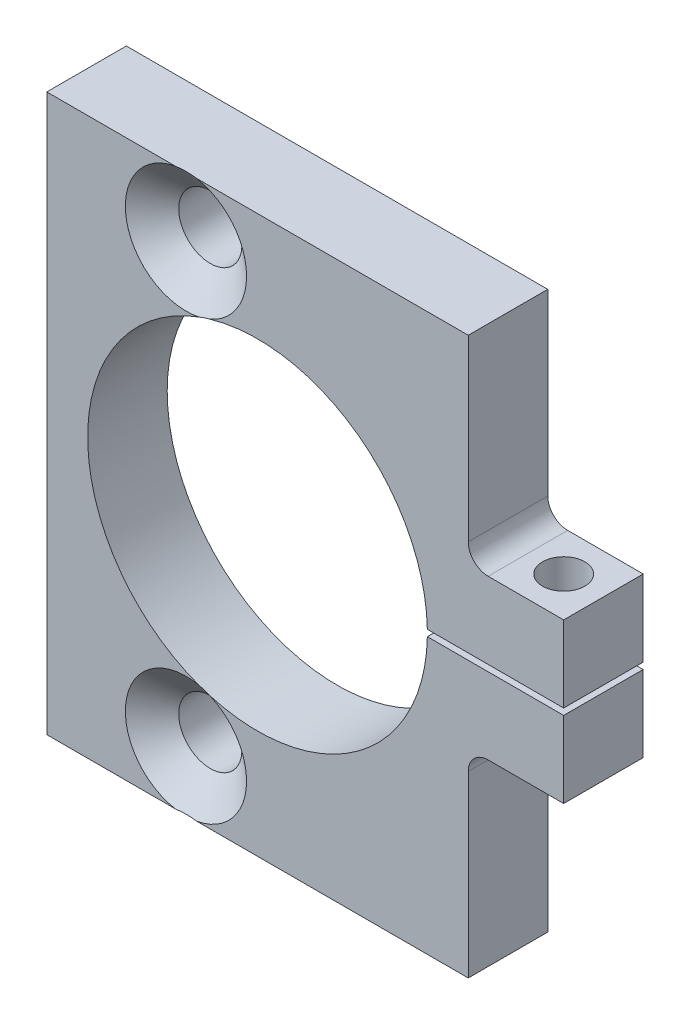
ISO-10303-21;
HEADER;
FILE_DESCRIPTION(('STEP AP214'),'2;1');
FILE_NAME('part.step','',(''),(''),'','','');
FILE_SCHEMA(('AUTOMOTIVE_DESIGN { 1 0 10303 214 1 1 1 1 }'));
ENDSEC;
DATA;
#1=APPLICATION_CONTEXT('core data for automotive mechanical design processes');
#2=APPLICATION_PROTOCOL_DEFINITION('international standard','automotive_design',2000,#1);
#3=PRODUCT_CONTEXT('',#1,'mechanical');
#4=PRODUCT('Part','Part','',(#3));
#5=PRODUCT_RELATED_PRODUCT_CATEGORY('part','',(#4));
#6=PRODUCT_DEFINITION_FORMATION('','',#4);
#7=PRODUCT_DEFINITION_CONTEXT('part definition',#1,'design');
#8=PRODUCT_DEFINITION('design','',#6,#7);
#9=PRODUCT_DEFINITION_SHAPE('','',#8);
#10=(LENGTH_UNIT() NAMED_UNIT(*) SI_UNIT(.MILLI.,.METRE.));
#11=(NAMED_UNIT(*) PLANE_ANGLE_UNIT() SI_UNIT($,.RADIAN.));
#12=(NAMED_UNIT(*) SI_UNIT($,.STERADIAN.) SOLID_ANGLE_UNIT());
#13=UNCERTAINTY_MEASURE_WITH_UNIT(LENGTH_MEASURE(1.E-05),#10,'distance_accuracy_value','');
#14=(GEOMETRIC_REPRESENTATION_CONTEXT(3) GLOBAL_UNCERTAINTY_ASSIGNED_CONTEXT((#13)) GLOBAL_UNIT_ASSIGNED_CONTEXT((#10,
#11,#12)) REPRESENTATION_CONTEXT('',''));
#15=CARTESIAN_POINT('',(0.,0.,0.));
#16=DIRECTION('',(0.,0.,1.));
#17=DIRECTION('',(1.,0.,0.));
#18=AXIS2_PLACEMENT_3D('',#15,#16,#17);
#19=CARTESIAN_POINT('',(41.275,44.45,12.7));
#20=DIRECTION('',(0.,0.,-1.));
#21=DIRECTION('',(-1.,0.,0.));
#22=AXIS2_PLACEMENT_3D('',#19,#20,#21);
#23=PLANE('',#22);
#24=DIRECTION('',(0.,1.,0.));
#25=VECTOR('',#24,1.);
#26=CARTESIAN_POINT('',(26.035,-44.45,12.7));
#27=LINE('',#26,#25);
#28=CARTESIAN_POINT('',(26.035,-44.45,12.7));
#29=VERTEX_POINT('',#28);
#30=CARTESIAN_POINT('',(26.035,-15.875,12.7));
#31=VERTEX_POINT('',#30);
#32=EDGE_CURVE('E174',#29,#31,#27,.T.);
#33=ORIENTED_EDGE('',*,*,#32,.T.);
#34=CARTESIAN_POINT('',(29.21,-15.875,12.7));
#35=DIRECTION('',(0.,0.,-1.));
#36=DIRECTION('',(-1.,0.,0.));
#37=AXIS2_PLACEMENT_3D('',#34,#35,#36);
#38=CIRCLE('',#37,3.175);
#39=CARTESIAN_POINT('',(29.21,-12.7,12.7));
#40=VERTEX_POINT('',#39);
#41=EDGE_CURVE('E402',#31,#40,#38,.T.);
#42=ORIENTED_EDGE('',*,*,#41,.T.);
#43=DIRECTION('',(1.,0.,0.));
#44=VECTOR('',#43,1.);
#45=CARTESIAN_POINT('',(41.275,-12.7,12.7));
#46=LINE('',#45,#44);
#47=CARTESIAN_POINT('',(41.275,-12.7,12.7));
#48=VERTEX_POINT('',#47);
#49=EDGE_CURVE('E406',#40,#48,#46,.T.);
#50=ORIENTED_EDGE('',*,*,#49,.T.);
#51=DIRECTION('',(0.,1.,0.));
#52=VECTOR('',#51,1.);
#53=CARTESIAN_POINT('',(41.275,-44.45,12.7));
#54=LINE('',#53,#52);
#55=CARTESIAN_POINT('',(41.275,-0.508000000000002,12.7));
#56=VERTEX_POINT('',#55);
#57=EDGE_CURVE('E181',#48,#56,#54,.T.);
#58=ORIENTED_EDGE('',*,*,#57,.T.);
#59=DIRECTION('',(1.,0.,0.));
#60=VECTOR('',#59,1.);
#61=CARTESIAN_POINT('',(16.1567832729253,-0.508000000000002,12.7));
#62=LINE('',#61,#60);
#63=CARTESIAN_POINT('',(19.5024430286064,-0.508000000000002,12.7));
#64=VERTEX_POINT('',#63);
#65=EDGE_CURVE('E409',#64,#56,#62,.T.);
#66=ORIENTED_EDGE('',*,*,#65,.F.);
#67=CARTESIAN_POINT('',(-7.62000000000001,0.,12.7));
#68=DIRECTION('',(0.,0.,1.));
#69=DIRECTION('',(1.,0.,0.));
#70=AXIS2_PLACEMENT_3D('',#67,#68,#69);
#71=CIRCLE('',#70,27.1272);
#72=CARTESIAN_POINT('',(-15.198154866507,-26.0471984800522,12.7));
#73=VERTEX_POINT('',#72);
#74=EDGE_CURVE('E319',#73,#64,#71,.T.);
#75=ORIENTED_EDGE('',*,*,#74,.F.);
#76=CARTESIAN_POINT('',(-19.05,-34.925,12.7));
#77=DIRECTION('',(0.,0.,1.));
#78=DIRECTION('',(1.,0.,0.));
#79=AXIS2_PLACEMENT_3D('',#76,#77,#78);
#80=CIRCLE('',#79,9.6774);
#81=CARTESIAN_POINT('',(-17.339314242767,-44.45,12.7));
#82=VERTEX_POINT('',#81);
#83=EDGE_CURVE('E312',#82,#73,#80,.T.);
#84=ORIENTED_EDGE('',*,*,#83,.F.);
#85=DIRECTION('',(1.,0.,0.));
#86=VECTOR('',#85,1.);
#87=CARTESIAN_POINT('',(-41.275,-44.45,12.7));
#88=LINE('',#87,#86);
#89=EDGE_CURVE('E329',#82,#29,#88,.T.);
#90=ORIENTED_EDGE('',*,*,#89,.T.);
#91=EDGE_LOOP('',(#33,#42,#50,#58,#66,#75,#84,#90));
#92=FACE_BOUND('',#91,.T.);
#93=ADVANCED_FACE('F37',(#92),#23,.F.);
#94=CARTESIAN_POINT('',(41.275,-44.45,12.7));
#95=DIRECTION('',(-1.,0.,0.));
#96=DIRECTION('',(0.,0.,1.));
#97=AXIS2_PLACEMENT_3D('',#94,#95,#96);
#98=PLANE('',#97);
#99=DIRECTION('',(0.,0.,1.));
#100=VECTOR('',#99,1.);
#101=CARTESIAN_POINT('',(41.275,-12.7,0.));
#102=LINE('',#101,#100);
#103=CARTESIAN_POINT('',(41.275,-12.7,0.));
#104=VERTEX_POINT('',#103);
#105=EDGE_CURVE('E166',#104,#48,#102,.T.);
#106=ORIENTED_EDGE('',*,*,#105,.F.);
#107=DIRECTION('',(0.,1.,0.));
#108=VECTOR('',#107,1.);
#109=CARTESIAN_POINT('',(41.275,-44.45,0.));
#110=LINE('',#109,#108);
#111=CARTESIAN_POINT('',(41.275,-0.508000000000002,0.));
#112=VERTEX_POINT('',#111);
#113=EDGE_CURVE('E179',#104,#112,#110,.T.);
#114=ORIENTED_EDGE('',*,*,#113,.T.);
#115=DIRECTION('',(0.,0.,1.));
#116=VECTOR('',#115,1.);
#117=CARTESIAN_POINT('',(41.275,-0.508000000000002,12.7));
#118=LINE('',#117,#116);
#119=EDGE_CURVE('E321',#112,#56,#118,.T.);
#120=ORIENTED_EDGE('',*,*,#119,.T.);
#121=ORIENTED_EDGE('',*,*,#57,.F.);
#122=EDGE_LOOP('',(#106,#114,#120,#121));
#123=FACE_BOUND('',#122,.T.);
#124=ADVANCED_FACE('F177',(#123),#98,.F.);
#125=CARTESIAN_POINT('',(-41.275,-44.45,12.7));
#126=DIRECTION('',(0.,1.,0.));
#127=DIRECTION('',(0.,0.,1.));
#128=AXIS2_PLACEMENT_3D('',#125,#126,#127);
#129=PLANE('',#128);
#130=DIRECTION('',(0.,0.,1.));
#131=VECTOR('',#130,1.);
#132=CARTESIAN_POINT('',(26.035,-44.45,0.));
#133=LINE('',#132,#131);
#134=CARTESIAN_POINT('',(26.035,-44.45,0.));
#135=VERTEX_POINT('',#134);
#136=EDGE_CURVE('E182',#135,#29,#133,.T.);
#137=ORIENTED_EDGE('',*,*,#136,.T.);
#138=ORIENTED_EDGE('',*,*,#89,.F.);
#139=CARTESIAN_POINT('',(-37.3789065683908,-44.45,21.9122225883036));
#140=CARTESIAN_POINT('',(-36.9777970751316,-44.45,21.613608142832));
#141=CARTESIAN_POINT('',(-36.5757182030523,-44.45,21.3162851750371));
#142=CARTESIAN_POINT('',(-35.7691723423192,-44.45,20.7248429279077));
#143=CARTESIAN_POINT('',(-35.3647052008841,-44.45,20.4307238570317));
#144=CARTESIAN_POINT('',(-34.552036967872,-44.45,19.8456662634173));
#145=CARTESIAN_POINT('',(-34.1438293601787,-44.45,19.5547367772536));
#146=CARTESIAN_POINT('',(-33.3240650152779,-44.45,18.9776482350215));
#147=CARTESIAN_POINT('',(-32.9125083558428,-44.45,18.6914890686434));
#148=CARTESIAN_POINT('',(-32.0657165219331,-44.45,18.11163921912));
#149=CARTESIAN_POINT('',(-31.6302844161899,-44.45,17.8182354451884));
#150=CARTESIAN_POINT('',(-30.7539279555369,-44.45,17.2396598245329));
#151=CARTESIAN_POINT('',(-30.31300327215,-44.45,16.9544884735553));
#152=CARTESIAN_POINT('',(-29.4248169839805,-44.45,16.3951131409073));
#153=CARTESIAN_POINT('',(-28.9775618312723,-44.45,16.1208989481245));
#154=CARTESIAN_POINT('',(-28.0747127136942,-44.45,15.586575121114));
#155=CARTESIAN_POINT('',(-27.6191199953543,-44.45,15.3264634011319));
#156=CARTESIAN_POINT('',(-26.9291347800008,-44.45,14.9511892102019));
#157=CARTESIAN_POINT('',(-26.6986310187849,-44.45,14.8288704811586));
#158=CARTESIAN_POINT('',(-26.2347870604906,-44.45,14.589746444186));
#159=CARTESIAN_POINT('',(-26.0014470191728,-44.45,14.4729408351964));
#160=CARTESIAN_POINT('',(-25.5315073168602,-44.45,14.2456979568016));
#161=CARTESIAN_POINT('',(-25.2949058203959,-44.45,14.1352644712514));
#162=CARTESIAN_POINT('',(-24.8183123695346,-44.45,13.9219486389381));
#163=CARTESIAN_POINT('',(-24.5783204574972,-44.45,13.8190661979319));
#164=CARTESIAN_POINT('',(-24.0974833822219,-44.45,13.6232698676627));
#165=CARTESIAN_POINT('',(-23.8566793421862,-44.45,13.5302554587116));
#166=CARTESIAN_POINT('',(-23.3713836697105,-44.45,13.354292684437));
#167=CARTESIAN_POINT('',(-23.1268918238386,-44.45,13.2713449042525));
#168=CARTESIAN_POINT('',(-22.6345450881543,-44.45,13.1172010893614));
#169=CARTESIAN_POINT('',(-22.3866948153663,-44.45,13.0459904039961));
#170=CARTESIAN_POINT('',(-21.8875875928328,-44.45,12.9168694133885));
#171=CARTESIAN_POINT('',(-21.6363315119804,-44.45,12.8589557809905));
#172=CARTESIAN_POINT('',(-21.165465772855,-44.45,12.7649389939614));
#173=CARTESIAN_POINT('',(-20.9462371463384,-44.45,12.7269346624769));
#174=CARTESIAN_POINT('',(-20.5058095935447,-44.45,12.6628834692872));
#175=CARTESIAN_POINT('',(-20.2846088856311,-44.45,12.6368488438681));
#176=CARTESIAN_POINT('',(-19.738850807055,-44.45,12.5884447246165));
#177=CARTESIAN_POINT('',(-19.4136183919624,-44.45,12.5732874636562));
#178=CARTESIAN_POINT('',(-18.7629724827444,-44.45,12.5710841611875));
#179=CARTESIAN_POINT('',(-18.4375589645166,-44.45,12.5840475836853));
#180=CARTESIAN_POINT('',(-17.7885183469015,-44.45,12.6373464678676));
#181=CARTESIAN_POINT('',(-17.4648946403033,-44.45,12.6777227701142));
#182=CARTESIAN_POINT('',(-16.8218568338894,-44.45,12.7836168356787));
#183=CARTESIAN_POINT('',(-16.5024430838655,-44.45,12.8491366746411));
#184=CARTESIAN_POINT('',(-15.6680633923492,-44.45,13.0507554836747));
#185=CARTESIAN_POINT('',(-15.1575164848273,-44.45,13.205265002259));
#186=CARTESIAN_POINT('',(-14.4036837478423,-44.45,13.4702594151555));
#187=CARTESIAN_POINT('',(-14.1542641883008,-44.45,13.5641928093957));
#188=CARTESIAN_POINT('',(-13.6592099819137,-44.45,13.7615655251344));
#189=CARTESIAN_POINT('',(-13.4135750086328,-44.45,13.8650040213603));
#190=CARTESIAN_POINT('',(-12.9228940548355,-44.45,14.0812887570081));
#191=CARTESIAN_POINT('',(-12.677892588514,-44.45,14.1942351735886));
#192=CARTESIAN_POINT('',(-12.1912632266391,-44.45,14.4271656175662));
#193=CARTESIAN_POINT('',(-11.9496353765326,-44.45,14.547149739657));
#194=CARTESIAN_POINT('',(-11.4695626594991,-44.45,14.793043474119));
#195=CARTESIAN_POINT('',(-11.2311163945184,-44.45,14.9189503659205));
#196=CARTESIAN_POINT('',(-10.7570045780567,-44.45,15.1758562240116));
#197=CARTESIAN_POINT('',(-10.5213388984705,-44.45,15.30685495451));
#198=CARTESIAN_POINT('',(-9.99314671211864,-44.45,15.6069300567459));
#199=CARTESIAN_POINT('',(-9.70132799793763,-44.45,15.777250968638));
#200=CARTESIAN_POINT('',(-9.1210741274887,-44.45,16.1235745750786));
#201=CARTESIAN_POINT('',(-8.83263913188914,-44.45,16.2995775379497));
#202=CARTESIAN_POINT('',(-8.25866696031577,-44.45,16.6563587652642));
#203=CARTESIAN_POINT('',(-7.97313034527321,-44.45,16.8371379305564));
#204=CARTESIAN_POINT('',(-7.40462675685225,-44.45,17.2026971333723));
#205=CARTESIAN_POINT('',(-7.1216598371577,-44.45,17.3874772542088));
#206=CARTESIAN_POINT('',(-6.27568135724284,-44.45,17.947162812062));
#207=CARTESIAN_POINT('',(-5.71602532175119,-44.45,18.3271415066067));
#208=CARTESIAN_POINT('',(-4.60364642423928,-44.45,19.0969492871714));
#209=CARTESIAN_POINT('',(-4.05092290644837,-44.45,19.4867774308207));
#210=CARTESIAN_POINT('',(-2.94911636600263,-44.45,20.2751460685569));
#211=CARTESIAN_POINT('',(-2.40005015089908,-44.45,20.6737100112717));
#212=CARTESIAN_POINT('',(-1.30617402706681,-44.45,21.4766481601603));
#213=CARTESIAN_POINT('',(-0.761364206019799,-44.45,21.8810224855435));
#214=CARTESIAN_POINT('',(0.32459011064002,-44.45,22.6941530540228));
#215=CARTESIAN_POINT('',(0.865736140748523,-44.45,23.1029072502087));
#216=CARTESIAN_POINT('',(1.94524232055057,-44.45,23.9240658806977));
#217=CARTESIAN_POINT('',(2.48360249017919,-44.45,24.3364702888231));
#218=CARTESIAN_POINT('',(3.97057820624368,-44.45,25.4820442771918));
#219=CARTESIAN_POINT('',(4.91677740578391,-44.45,26.2183494667041));
#220=CARTESIAN_POINT('',(6.80415094930306,-44.45,27.6976109581132));
#221=CARTESIAN_POINT('',(7.74532461824585,-44.45,28.4405681193342));
#222=CARTESIAN_POINT('',(9.61826568990613,-44.45,29.9269393962963));
#223=CARTESIAN_POINT('',(10.5500558166197,-44.45,30.6703248956648));
#224=CARTESIAN_POINT('',(11.9454719689628,-44.45,31.7880879066351));
#225=CARTESIAN_POINT('',(12.4101973791179,-44.45,32.1610946663902));
#226=CARTESIAN_POINT('',(13.3389959089699,-44.45,32.9079180281409));
#227=CARTESIAN_POINT('',(13.8030690296602,-44.45,33.281734628901));
#228=CARTESIAN_POINT('',(14.2668568821521,-44.45,33.6559049075208));
#229=B_SPLINE_CURVE_WITH_KNOTS('',3,(#139,#140,#141,#142,#143,#144,#145,#146,#147,#148,#149,
#150,#151,#152,#153,#154,#155,#156,#157,#158,#159,#160,#161,#162,#163,#164,#165,#166,#167,#168,
#169,#170,#171,#172,#173,#174,#175,#176,#177,#178,#179,#180,#181,#182,#183,#184,#185,#186,#187,
#188,#189,#190,#191,#192,#193,#194,#195,#196,#197,#198,#199,#200,#201,#202,#203,#204,#205,#206,
#207,#208,#209,#210,#211,#212,#213,#214,#215,#216,#217,#218,#219,#220,#221,#222,#223,#224,#225,
#226,#227,#228),.UNSPECIFIED.,.F.,.F.,(4,2,2,2,2,2,2,2,2,2,2,2,2,2,2,2,2,2,2,2,2,2,2,2,2,2,2,2,
2,2,2,2,2,2,2,2,2,2,2,2,2,2,2,2,4),(0.,1.50018508266125,3.0004671972828,4.50425457600884,
6.00800713250038,7.58311210459571,9.15831173056199,10.7320074401641,12.305469761833,
13.0882550462338,13.870997534725,14.6542001418307,15.437392972273,16.2116318306802,
16.9859156714355,17.7592255816378,18.5323417847619,19.1995251441862,19.8673890377,
20.8428895443382,21.8187184062641,22.7960042879146,23.7733708636462,25.370429140329,
26.1698778860053,26.9692572856691,27.7784819985516,28.5877176022014,29.3965850529846,
30.2054150915161,31.2189939035156,32.2326206498303,33.2464399626525,34.2602804068025,
36.2894954034371,38.3185169796029,40.3538887716179,42.389302382315,44.4238029902121,
46.4582890194212,50.0550392329909,53.652260990764,57.2282365312682,59.0159533495095,
60.8036674422628),.UNSPECIFIED.);
#230=CARTESIAN_POINT('',(-20.760685757233,-44.45,12.7));
#231=VERTEX_POINT('',#230);
#232=EDGE_CURVE('E337',#82,#231,#229,.F.);
#233=ORIENTED_EDGE('',*,*,#232,.T.);
#234=CARTESIAN_POINT('',(-41.275,-44.45,12.7));
#235=VERTEX_POINT('',#234);
#236=EDGE_CURVE('E196',#235,#231,#88,.T.);
#237=ORIENTED_EDGE('',*,*,#236,.F.);
#238=DIRECTION('',(0.,0.,-1.));
#239=VECTOR('',#238,1.);
#240=CARTESIAN_POINT('',(-41.275,-44.45,12.7));
#241=LINE('',#240,#239);
#242=CARTESIAN_POINT('',(-41.275,-44.45,0.));
#243=VERTEX_POINT('',#242);
#244=EDGE_CURVE('E204',#235,#243,#241,.T.);
#245=ORIENTED_EDGE('',*,*,#244,.T.);
#246=DIRECTION('',(1.,0.,0.));
#247=VECTOR('',#246,1.);
#248=CARTESIAN_POINT('',(-41.275,-44.45,0.));
#249=LINE('',#248,#247);
#250=EDGE_CURVE('E200',#243,#135,#249,.T.);
#251=ORIENTED_EDGE('',*,*,#250,.T.);
#252=EDGE_LOOP('',(#137,#138,#233,#237,#245,#251));
#253=FACE_BOUND('',#252,.T.);
#254=ADVANCED_FACE('F290',(#253),#129,.F.);
#255=CARTESIAN_POINT('',(41.275,44.45,0.));
#256=DIRECTION('',(0.,0.,-1.));
#257=DIRECTION('',(-1.,0.,0.));
#258=AXIS2_PLACEMENT_3D('',#255,#256,#257);
#259=PLANE('',#258);
#260=CARTESIAN_POINT('',(-19.05,34.925,0.));
#261=DIRECTION('',(0.,0.,1.));
#262=DIRECTION('',(1.,0.,0.));
#263=AXIS2_PLACEMENT_3D('',#260,#261,#262);
#264=CIRCLE('',#263,5.0419);
#265=CARTESIAN_POINT('',(-14.0081,34.925,0.));
#266=VERTEX_POINT('',#265);
#267=EDGE_CURVE('E258',#266,#266,#264,.T.);
#268=ORIENTED_EDGE('',*,*,#267,.T.);
#269=EDGE_LOOP('',(#268));
#270=FACE_BOUND('',#269,.T.);
#271=CARTESIAN_POINT('',(-19.05,-34.925,0.));
#272=DIRECTION('',(0.,0.,1.));
#273=DIRECTION('',(1.,0.,0.));
#274=AXIS2_PLACEMENT_3D('',#271,#272,#273);
#275=CIRCLE('',#274,5.0419);
#276=CARTESIAN_POINT('',(-14.0081,-34.925,0.));
#277=VERTEX_POINT('',#276);
#278=EDGE_CURVE('E364',#277,#277,#275,.T.);
#279=ORIENTED_EDGE('',*,*,#278,.T.);
#280=EDGE_LOOP('',(#279));
#281=FACE_BOUND('',#280,.T.);
#282=DIRECTION('',(1.,0.,0.));
#283=VECTOR('',#282,1.);
#284=CARTESIAN_POINT('',(41.275,-12.7,0.));
#285=LINE('',#284,#283);
#286=CARTESIAN_POINT('',(29.21,-12.7,0.));
#287=VERTEX_POINT('',#286);
#288=EDGE_CURVE('E161',#287,#104,#285,.T.);
#289=ORIENTED_EDGE('',*,*,#288,.F.);
#290=CARTESIAN_POINT('',(29.21,-15.875,0.));
#291=DIRECTION('',(0.,0.,-1.));
#292=DIRECTION('',(-1.,0.,0.));
#293=AXIS2_PLACEMENT_3D('',#290,#291,#292);
#294=CIRCLE('',#293,3.175);
#295=CARTESIAN_POINT('',(26.035,-15.875,0.));
#296=VERTEX_POINT('',#295);
#297=EDGE_CURVE('E404',#287,#296,#294,.F.);
#298=ORIENTED_EDGE('',*,*,#297,.T.);
#299=DIRECTION('',(0.,1.,0.));
#300=VECTOR('',#299,1.);
#301=CARTESIAN_POINT('',(26.035,-44.45,0.));
#302=LINE('',#301,#300);
#303=EDGE_CURVE('E173',#135,#296,#302,.T.);
#304=ORIENTED_EDGE('',*,*,#303,.F.);
#305=ORIENTED_EDGE('',*,*,#250,.F.);
#306=DIRECTION('',(0.,-1.,0.));
#307=VECTOR('',#306,1.);
#308=CARTESIAN_POINT('',(-41.275,-44.45,0.));
#309=LINE('',#308,#307);
#310=CARTESIAN_POINT('',(-41.275,44.45,0.));
#311=VERTEX_POINT('',#310);
#312=EDGE_CURVE('E191',#311,#243,#309,.T.);
#313=ORIENTED_EDGE('',*,*,#312,.F.);
#314=DIRECTION('',(-1.,0.,0.));
#315=VECTOR('',#314,1.);
#316=CARTESIAN_POINT('',(-41.275,44.45,0.));
#317=LINE('',#316,#315);
#318=CARTESIAN_POINT('',(26.035,44.45,0.));
#319=VERTEX_POINT('',#318);
#320=EDGE_CURVE('E188',#319,#311,#317,.T.);
#321=ORIENTED_EDGE('',*,*,#320,.F.);
#322=DIRECTION('',(0.,-1.,0.));
#323=VECTOR('',#322,1.);
#324=CARTESIAN_POINT('',(26.035,44.45,0.));
#325=LINE('',#324,#323);
#326=CARTESIAN_POINT('',(26.035,15.875,0.));
#327=VERTEX_POINT('',#326);
#328=EDGE_CURVE('E349',#319,#327,#325,.T.);
#329=ORIENTED_EDGE('',*,*,#328,.T.);
#330=CARTESIAN_POINT('',(29.21,15.875,0.));
#331=DIRECTION('',(0.,0.,-1.));
#332=DIRECTION('',(-1.,0.,0.));
#333=AXIS2_PLACEMENT_3D('',#330,#331,#332);
#334=CIRCLE('',#333,3.175);
#335=CARTESIAN_POINT('',(29.21,12.7,0.));
#336=VERTEX_POINT('',#335);
#337=EDGE_CURVE('E11',#327,#336,#334,.F.);
#338=ORIENTED_EDGE('',*,*,#337,.T.);
#339=DIRECTION('',(1.,0.,0.));
#340=VECTOR('',#339,1.);
#341=CARTESIAN_POINT('',(41.275,12.7,0.));
#342=LINE('',#341,#340);
#343=CARTESIAN_POINT('',(41.275,12.7,0.));
#344=VERTEX_POINT('',#343);
#345=EDGE_CURVE('E351',#336,#344,#342,.T.);
#346=ORIENTED_EDGE('',*,*,#345,.T.);
#347=CARTESIAN_POINT('',(41.275,0.507999999999998,0.));
#348=VERTEX_POINT('',#347);
#349=EDGE_CURVE('E189',#348,#344,#110,.T.);
#350=ORIENTED_EDGE('',*,*,#349,.F.);
#351=DIRECTION('',(-1.,0.,0.));
#352=VECTOR('',#351,1.);
#353=CARTESIAN_POINT('',(16.1567832729253,0.507999999999998,0.));
#354=LINE('',#353,#352);
#355=CARTESIAN_POINT('',(19.5024430286064,0.507999999999998,0.));
#356=VERTEX_POINT('',#355);
#357=EDGE_CURVE('E413',#348,#356,#354,.T.);
#358=ORIENTED_EDGE('',*,*,#357,.T.);
#359=CARTESIAN_POINT('',(-7.62000000000001,0.,0.));
#360=DIRECTION('',(0.,0.,1.));
#361=DIRECTION('',(1.,0.,0.));
#362=AXIS2_PLACEMENT_3D('',#359,#360,#361);
#363=CIRCLE('',#362,27.1272);
#364=CARTESIAN_POINT('',(19.5024430286064,-0.508000000000002,0.));
#365=VERTEX_POINT('',#364);
#366=EDGE_CURVE('E194',#356,#365,#363,.T.);
#367=ORIENTED_EDGE('',*,*,#366,.T.);
#368=DIRECTION('',(1.,0.,0.));
#369=VECTOR('',#368,1.);
#370=CARTESIAN_POINT('',(16.1567832729253,-0.508000000000002,0.));
#371=LINE('',#370,#369);
#372=EDGE_CURVE('E187',#365,#112,#371,.T.);
#373=ORIENTED_EDGE('',*,*,#372,.T.);
#374=ORIENTED_EDGE('',*,*,#113,.F.);
#375=EDGE_LOOP('',(#289,#298,#304,#305,#313,#321,#329,#338,#346,#350,#358,#367,#373,#374));
#376=FACE_BOUND('',#375,.T.);
#377=ADVANCED_FACE('F185',(#270,#281,#376),#259,.T.);
#378=CARTESIAN_POINT('',(34.925,44.45,6.35));
#379=DIRECTION('',(0.,1.,0.));
#380=DIRECTION('',(0.,0.,1.));
#381=AXIS2_PLACEMENT_3D('',#378,#379,#380);
#382=CYLINDRICAL_SURFACE('',#381,3.37819999999998);
#383=CARTESIAN_POINT('',(34.925,-0.508000000000002,6.35));
#384=DIRECTION('',(0.,-1.,0.));
#385=DIRECTION('',(0.,0.,-1.));
#386=AXIS2_PLACEMENT_3D('',#383,#384,#385);
#387=CIRCLE('',#386,3.37819999999998);
#388=CARTESIAN_POINT('',(34.925,-0.508000000000002,2.97180000000002));
#389=VERTEX_POINT('',#388);
#390=EDGE_CURVE('E217',#389,#389,#387,.T.);
#391=ORIENTED_EDGE('',*,*,#390,.F.);
#392=EDGE_LOOP('',(#391));
#393=FACE_BOUND('',#392,.T.);
#394=CARTESIAN_POINT('',(34.925,-12.7,6.35));
#395=DIRECTION('',(0.,-1.,0.));
#396=DIRECTION('',(1.,0.,0.));
#397=AXIS2_PLACEMENT_3D('',#394,#395,#396);
#398=CIRCLE('',#397,3.37819999999998);
#399=CARTESIAN_POINT('',(38.3032,-12.7,6.35));
#400=VERTEX_POINT('',#399);
#401=EDGE_CURVE('E341',#400,#400,#398,.F.);
#402=ORIENTED_EDGE('',*,*,#401,.F.);
#403=EDGE_LOOP('',(#402));
#404=FACE_BOUND('',#403,.T.);
#405=ADVANCED_FACE('F295',(#393,#404),#382,.F.);
#406=CARTESIAN_POINT('',(-16.9078043284765,-25.4876768379531,12.7));
#407=VERTEX_POINT('',#406);
#408=EDGE_CURVE('E304',#407,#231,#80,.T.);
#409=ORIENTED_EDGE('',*,*,#408,.F.);
#410=CARTESIAN_POINT('',(-16.9078043284766,25.4876768379531,12.7));
#411=VERTEX_POINT('',#410);
#412=EDGE_CURVE('E307',#411,#407,#71,.T.);
#413=ORIENTED_EDGE('',*,*,#412,.F.);
#414=CARTESIAN_POINT('',(-19.05,34.925,12.7));
#415=DIRECTION('',(0.,0.,1.));
#416=DIRECTION('',(1.,0.,0.));
#417=AXIS2_PLACEMENT_3D('',#414,#415,#416);
#418=CIRCLE('',#417,9.6774);
#419=CARTESIAN_POINT('',(-20.760685757233,44.45,12.7));
#420=VERTEX_POINT('',#419);
#421=EDGE_CURVE('E433',#420,#411,#418,.T.);
#422=ORIENTED_EDGE('',*,*,#421,.F.);
#423=DIRECTION('',(-1.,0.,0.));
#424=VECTOR('',#423,1.);
#425=CARTESIAN_POINT('',(-41.275,44.45,12.7));
#426=LINE('',#425,#424);
#427=CARTESIAN_POINT('',(-41.275,44.45,12.7));
#428=VERTEX_POINT('',#427);
#429=EDGE_CURVE('E326',#420,#428,#426,.T.);
#430=ORIENTED_EDGE('',*,*,#429,.T.);
#431=DIRECTION('',(0.,-1.,0.));
#432=VECTOR('',#431,1.);
#433=CARTESIAN_POINT('',(-41.275,-44.45,12.7));
#434=LINE('',#433,#432);
#435=EDGE_CURVE('E328',#428,#235,#434,.T.);
#436=ORIENTED_EDGE('',*,*,#435,.T.);
#437=ORIENTED_EDGE('',*,*,#236,.T.);
#438=EDGE_LOOP('',(#409,#413,#422,#430,#436,#437));
#439=FACE_BOUND('',#438,.T.);
#440=ADVANCED_FACE('F286',(#439),#23,.F.);
#441=CARTESIAN_POINT('',(41.275,0.507999999999998,12.7));
#442=VERTEX_POINT('',#441);
#443=CARTESIAN_POINT('',(41.275,12.7,12.7));
#444=VERTEX_POINT('',#443);
#445=EDGE_CURVE('E203',#442,#444,#54,.T.);
#446=ORIENTED_EDGE('',*,*,#445,.T.);
#447=DIRECTION('',(1.,0.,0.));
#448=VECTOR('',#447,1.);
#449=CARTESIAN_POINT('',(41.275,12.7,12.7));
#450=LINE('',#449,#448);
#451=CARTESIAN_POINT('',(29.21,12.7,12.7));
#452=VERTEX_POINT('',#451);
#453=EDGE_CURVE('E352',#452,#444,#450,.T.);
#454=ORIENTED_EDGE('',*,*,#453,.F.);
#455=CARTESIAN_POINT('',(29.21,15.875,12.7));
#456=DIRECTION('',(0.,0.,-1.));
#457=DIRECTION('',(-1.,0.,0.));
#458=AXIS2_PLACEMENT_3D('',#455,#456,#457);
#459=CIRCLE('',#458,3.175);
#460=CARTESIAN_POINT('',(26.035,15.875,12.7));
#461=VERTEX_POINT('',#460);
#462=EDGE_CURVE('E45',#452,#461,#459,.T.);
#463=ORIENTED_EDGE('',*,*,#462,.T.);
#464=DIRECTION('',(0.,-1.,0.));
#465=VECTOR('',#464,1.);
#466=CARTESIAN_POINT('',(26.035,44.45,12.7));
#467=LINE('',#466,#465);
#468=CARTESIAN_POINT('',(26.035,44.45,12.7));
#469=VERTEX_POINT('',#468);
#470=EDGE_CURVE('E344',#469,#461,#467,.T.);
#471=ORIENTED_EDGE('',*,*,#470,.F.);
#472=CARTESIAN_POINT('',(-17.339314242767,44.45,12.7));
#473=VERTEX_POINT('',#472);
#474=EDGE_CURVE('E327',#469,#473,#426,.T.);
#475=ORIENTED_EDGE('',*,*,#474,.T.);
#476=CARTESIAN_POINT('',(-15.1981548665071,26.0471984800522,12.7));
#477=VERTEX_POINT('',#476);
#478=EDGE_CURVE('E371',#477,#473,#418,.T.);
#479=ORIENTED_EDGE('',*,*,#478,.F.);
#480=CARTESIAN_POINT('',(19.5024430286064,0.507999999999998,12.7));
#481=VERTEX_POINT('',#480);
#482=EDGE_CURVE('E318',#481,#477,#71,.T.);
#483=ORIENTED_EDGE('',*,*,#482,.F.);
#484=DIRECTION('',(-1.,0.,0.));
#485=VECTOR('',#484,1.);
#486=CARTESIAN_POINT('',(16.1567832729253,0.507999999999998,12.7));
#487=LINE('',#486,#485);
#488=EDGE_CURVE('E414',#442,#481,#487,.T.);
#489=ORIENTED_EDGE('',*,*,#488,.F.);
#490=EDGE_LOOP('',(#446,#454,#463,#471,#475,#479,#483,#489));
#491=FACE_BOUND('',#490,.T.);
#492=ADVANCED_FACE('F271',(#491),#23,.F.);
#493=ORIENTED_EDGE('',*,*,#349,.T.);
#494=DIRECTION('',(0.,0.,1.));
#495=VECTOR('',#494,1.);
#496=CARTESIAN_POINT('',(41.275,12.7,0.));
#497=LINE('',#496,#495);
#498=EDGE_CURVE('E357',#344,#444,#497,.T.);
#499=ORIENTED_EDGE('',*,*,#498,.T.);
#500=ORIENTED_EDGE('',*,*,#445,.F.);
#501=DIRECTION('',(0.,0.,-1.));
#502=VECTOR('',#501,1.);
#503=CARTESIAN_POINT('',(41.275,0.508000000000002,12.7));
#504=LINE('',#503,#502);
#505=EDGE_CURVE('E416',#442,#348,#504,.T.);
#506=ORIENTED_EDGE('',*,*,#505,.T.);
#507=EDGE_LOOP('',(#493,#499,#500,#506));
#508=FACE_BOUND('',#507,.T.);
#509=ADVANCED_FACE('F267',(#508),#98,.F.);
#510=CARTESIAN_POINT('',(-41.275,44.45,12.7));
#511=DIRECTION('',(0.,-1.,0.));
#512=DIRECTION('',(0.,0.,-1.));
#513=AXIS2_PLACEMENT_3D('',#510,#511,#512);
#514=PLANE('',#513);
#515=ORIENTED_EDGE('',*,*,#474,.F.);
#516=DIRECTION('',(0.,0.,1.));
#517=VECTOR('',#516,1.);
#518=CARTESIAN_POINT('',(26.035,44.45,0.));
#519=LINE('',#518,#517);
#520=EDGE_CURVE('E354',#319,#469,#519,.T.);
#521=ORIENTED_EDGE('',*,*,#520,.F.);
#522=ORIENTED_EDGE('',*,*,#320,.T.);
#523=DIRECTION('',(0.,0.,-1.));
#524=VECTOR('',#523,1.);
#525=CARTESIAN_POINT('',(-41.275,44.45,12.7));
#526=LINE('',#525,#524);
#527=EDGE_CURVE('E207',#428,#311,#526,.T.);
#528=ORIENTED_EDGE('',*,*,#527,.F.);
#529=ORIENTED_EDGE('',*,*,#429,.F.);
#530=CARTESIAN_POINT('',(-37.3789065683908,44.45,21.9122225883036));
#531=CARTESIAN_POINT('',(-36.9777970751316,44.45,21.613608142832));
#532=CARTESIAN_POINT('',(-36.5757182030523,44.45,21.3162851750371));
#533=CARTESIAN_POINT('',(-35.7691723423192,44.45,20.7248429279077));
#534=CARTESIAN_POINT('',(-35.3647052008841,44.45,20.4307238570317));
#535=CARTESIAN_POINT('',(-34.552036967872,44.45,19.8456662634173));
#536=CARTESIAN_POINT('',(-34.1438293601787,44.45,19.5547367772536));
#537=CARTESIAN_POINT('',(-33.3240650152779,44.45,18.9776482350215));
#538=CARTESIAN_POINT('',(-32.9125083558428,44.45,18.6914890686434));
#539=CARTESIAN_POINT('',(-32.0657165219331,44.45,18.11163921912));
#540=CARTESIAN_POINT('',(-31.6302844161899,44.45,17.8182354451884));
#541=CARTESIAN_POINT('',(-30.7539279555369,44.45,17.2396598245329));
#542=CARTESIAN_POINT('',(-30.31300327215,44.45,16.9544884735553));
#543=CARTESIAN_POINT('',(-29.4248169839805,44.45,16.3951131409073));
#544=CARTESIAN_POINT('',(-28.9775618312723,44.45,16.1208989481245));
#545=CARTESIAN_POINT('',(-28.0747127136942,44.45,15.586575121114));
#546=CARTESIAN_POINT('',(-27.6191199953543,44.45,15.3264634011319));
#547=CARTESIAN_POINT('',(-26.9291347800008,44.45,14.9511892102019));
#548=CARTESIAN_POINT('',(-26.6986310187849,44.45,14.8288704811586));
#549=CARTESIAN_POINT('',(-26.2347870604906,44.45,14.589746444186));
#550=CARTESIAN_POINT('',(-26.0014470191728,44.45,14.4729408351964));
#551=CARTESIAN_POINT('',(-25.5315073168602,44.45,14.2456979568016));
#552=CARTESIAN_POINT('',(-25.2949058203959,44.45,14.1352644712514));
#553=CARTESIAN_POINT('',(-24.8183123695346,44.45,13.9219486389381));
#554=CARTESIAN_POINT('',(-24.5783204574972,44.45,13.8190661979319));
#555=CARTESIAN_POINT('',(-24.0974833822219,44.45,13.6232698676627));
#556=CARTESIAN_POINT('',(-23.8566793421862,44.45,13.5302554587116));
#557=CARTESIAN_POINT('',(-23.3713836697105,44.45,13.354292684437));
#558=CARTESIAN_POINT('',(-23.1268918238386,44.45,13.2713449042525));
#559=CARTESIAN_POINT('',(-22.6345450881543,44.45,13.1172010893614));
#560=CARTESIAN_POINT('',(-22.3866948153663,44.45,13.0459904039961));
#561=CARTESIAN_POINT('',(-21.8875875928328,44.45,12.9168694133885));
#562=CARTESIAN_POINT('',(-21.6363315119804,44.45,12.8589557809905));
#563=CARTESIAN_POINT('',(-21.165465772855,44.45,12.7649389939614));
#564=CARTESIAN_POINT('',(-20.9462371463384,44.45,12.7269346624769));
#565=CARTESIAN_POINT('',(-20.5058095935447,44.45,12.6628834692872));
#566=CARTESIAN_POINT('',(-20.2846088856311,44.45,12.6368488438681));
#567=CARTESIAN_POINT('',(-19.738850807055,44.45,12.5884447246165));
#568=CARTESIAN_POINT('',(-19.4136183919624,44.45,12.5732874636562));
#569=CARTESIAN_POINT('',(-18.7629724827444,44.45,12.5710841611875));
#570=CARTESIAN_POINT('',(-18.4375589645166,44.45,12.5840475836853));
#571=CARTESIAN_POINT('',(-17.7885183469015,44.45,12.6373464678676));
#572=CARTESIAN_POINT('',(-17.4648946403033,44.45,12.6777227701142));
#573=CARTESIAN_POINT('',(-16.8218568338894,44.45,12.7836168356787));
#574=CARTESIAN_POINT('',(-16.5024430838655,44.45,12.8491366746411));
#575=CARTESIAN_POINT('',(-15.6680633923492,44.45,13.0507554836747));
#576=CARTESIAN_POINT('',(-15.1575164848273,44.45,13.205265002259));
#577=CARTESIAN_POINT('',(-14.4036837478423,44.45,13.4702594151555));
#578=CARTESIAN_POINT('',(-14.1542641883008,44.45,13.5641928093957));
#579=CARTESIAN_POINT('',(-13.6592099819137,44.45,13.7615655251344));
#580=CARTESIAN_POINT('',(-13.4135750086328,44.45,13.8650040213603));
#581=CARTESIAN_POINT('',(-12.9228940548355,44.45,14.0812887570081));
#582=CARTESIAN_POINT('',(-12.677892588514,44.45,14.1942351735886));
#583=CARTESIAN_POINT('',(-12.1912632266391,44.45,14.4271656175662));
#584=CARTESIAN_POINT('',(-11.9496353765326,44.45,14.547149739657));
#585=CARTESIAN_POINT('',(-11.4695626594991,44.45,14.793043474119));
#586=CARTESIAN_POINT('',(-11.2311163945184,44.45,14.9189503659205));
#587=CARTESIAN_POINT('',(-10.7570045780567,44.45,15.1758562240116));
#588=CARTESIAN_POINT('',(-10.5213388984705,44.45,15.30685495451));
#589=CARTESIAN_POINT('',(-9.99314671211864,44.45,15.6069300567459));
#590=CARTESIAN_POINT('',(-9.70132799793763,44.45,15.777250968638));
#591=CARTESIAN_POINT('',(-9.1210741274887,44.45,16.1235745750786));
#592=CARTESIAN_POINT('',(-8.83263913188914,44.45,16.2995775379497));
#593=CARTESIAN_POINT('',(-8.25866696031577,44.45,16.6563587652642));
#594=CARTESIAN_POINT('',(-7.97313034527321,44.45,16.8371379305564));
#595=CARTESIAN_POINT('',(-7.40462675685225,44.45,17.2026971333723));
#596=CARTESIAN_POINT('',(-7.1216598371577,44.45,17.3874772542088));
#597=CARTESIAN_POINT('',(-6.27568135724284,44.45,17.947162812062));
#598=CARTESIAN_POINT('',(-5.71602532175119,44.45,18.3271415066067));
#599=CARTESIAN_POINT('',(-4.60364642423928,44.45,19.0969492871714));
#600=CARTESIAN_POINT('',(-4.05092290644837,44.45,19.4867774308207));
#601=CARTESIAN_POINT('',(-2.94911636600263,44.45,20.2751460685569));
#602=CARTESIAN_POINT('',(-2.40005015089908,44.45,20.6737100112717));
#603=CARTESIAN_POINT('',(-1.30617402706681,44.45,21.4766481601603));
#604=CARTESIAN_POINT('',(-0.761364206019799,44.45,21.8810224855435));
#605=CARTESIAN_POINT('',(0.32459011064002,44.45,22.6941530540228));
#606=CARTESIAN_POINT('',(0.865736140748523,44.45,23.1029072502087));
#607=CARTESIAN_POINT('',(1.94524232055057,44.45,23.9240658806977));
#608=CARTESIAN_POINT('',(2.48360249017919,44.45,24.3364702888231));
#609=CARTESIAN_POINT('',(3.97057820624368,44.45,25.4820442771918));
#610=CARTESIAN_POINT('',(4.91677740578391,44.45,26.2183494667041));
#611=CARTESIAN_POINT('',(6.80415094930306,44.45,27.6976109581132));
#612=CARTESIAN_POINT('',(7.74532461824585,44.45,28.4405681193342));
#613=CARTESIAN_POINT('',(9.61826568990613,44.45,29.9269393962963));
#614=CARTESIAN_POINT('',(10.5500558166197,44.45,30.6703248956648));
#615=CARTESIAN_POINT('',(11.9454719689628,44.45,31.7880879066351));
#616=CARTESIAN_POINT('',(12.4101973791179,44.45,32.1610946663902));
#617=CARTESIAN_POINT('',(13.3389959089699,44.45,32.9079180281409));
#618=CARTESIAN_POINT('',(13.8030690296602,44.45,33.281734628901));
#619=CARTESIAN_POINT('',(14.2668568821521,44.45,33.6559049075208));
#620=B_SPLINE_CURVE_WITH_KNOTS('',3,(#530,#531,#532,#533,#534,#535,#536,#537,#538,#539,#540,
#541,#542,#543,#544,#545,#546,#547,#548,#549,#550,#551,#552,#553,#554,#555,#556,#557,#558,#559,
#560,#561,#562,#563,#564,#565,#566,#567,#568,#569,#570,#571,#572,#573,#574,#575,#576,#577,#578,
#579,#580,#581,#582,#583,#584,#585,#586,#587,#588,#589,#590,#591,#592,#593,#594,#595,#596,#597,
#598,#599,#600,#601,#602,#603,#604,#605,#606,#607,#608,#609,#610,#611,#612,#613,#614,#615,#616,
#617,#618,#619),.UNSPECIFIED.,.F.,.F.,(4,2,2,2,2,2,2,2,2,2,2,2,2,2,2,2,2,2,2,2,2,2,2,2,2,2,2,2,
2,2,2,2,2,2,2,2,2,2,2,2,2,2,2,2,4),(0.,1.50018508266125,3.0004671972828,4.50425457600884,
6.00800713250038,7.58311210459571,9.15831173056199,10.7320074401641,12.305469761833,
13.0882550462338,13.870997534725,14.6542001418307,15.437392972273,16.2116318306802,
16.9859156714355,17.7592255816378,18.5323417847619,19.1995251441862,19.8673890377,
20.8428895443382,21.8187184062641,22.7960042879146,23.7733708636462,25.370429140329,
26.1698778860053,26.9692572856691,27.7784819985516,28.5877176022014,29.3965850529846,
30.2054150915161,31.2189939035156,32.2326206498303,33.2464399626525,34.2602804068025,
36.2894954034371,38.3185169796029,40.3538887716179,42.389302382315,44.4238029902121,
46.4582890194212,50.0550392329909,53.652260990764,57.2282365312682,59.0159533495095,
60.8036674422628),.UNSPECIFIED.);
#621=EDGE_CURVE('E221',#420,#473,#620,.T.);
#622=ORIENTED_EDGE('',*,*,#621,.T.);
#623=EDGE_LOOP('',(#515,#521,#522,#528,#529,#622));
#624=FACE_BOUND('',#623,.T.);
#625=ADVANCED_FACE('F261',(#624),#514,.F.);
#626=CARTESIAN_POINT('',(-41.275,-44.45,12.7));
#627=DIRECTION('',(1.,0.,0.));
#628=DIRECTION('',(0.,0.,-1.));
#629=AXIS2_PLACEMENT_3D('',#626,#627,#628);
#630=PLANE('',#629);
#631=ORIENTED_EDGE('',*,*,#312,.T.);
#632=ORIENTED_EDGE('',*,*,#244,.F.);
#633=ORIENTED_EDGE('',*,*,#435,.F.);
#634=ORIENTED_EDGE('',*,*,#527,.T.);
#635=EDGE_LOOP('',(#631,#632,#633,#634));
#636=FACE_BOUND('',#635,.T.);
#637=ADVANCED_FACE('F266',(#636),#630,.F.);
#638=CARTESIAN_POINT('',(-7.62000000000001,0.,0.));
#639=DIRECTION('',(0.,0.,1.));
#640=DIRECTION('',(1.,0.,0.));
#641=AXIS2_PLACEMENT_3D('',#638,#639,#640);
#642=CYLINDRICAL_SURFACE('',#641,27.1272);
#643=ORIENTED_EDGE('',*,*,#412,.T.);
#644=CARTESIAN_POINT('',(-19.1375326795694,-24.5607699556641,13.2766289921739));
#645=CARTESIAN_POINT('',(-18.9614040049407,-24.6433675725058,13.2060685615843));
#646=CARTESIAN_POINT('',(-18.7827682884731,-24.7248218832202,13.140199723214));
#647=CARTESIAN_POINT('',(-18.420520147925,-24.8851960607864,13.0192158685378));
#648=CARTESIAN_POINT('',(-18.2369021422417,-24.96411284881,12.9641135324819));
#649=CARTESIAN_POINT('',(-17.8648503925541,-25.1190899300615,12.8661289395033));
#650=CARTESIAN_POINT('',(-17.6764095829065,-25.1951455751464,12.8232658798385));
#651=CARTESIAN_POINT('',(-17.2957004854439,-25.3437874527428,12.7512209313879));
#652=CARTESIAN_POINT('',(-17.1034342266687,-25.4163754584985,12.7220319813495));
#653=CARTESIAN_POINT('',(-16.6280429552848,-25.5896418008958,12.6684928061795));
#654=CARTESIAN_POINT('',(-16.3431577647644,-25.6881746366399,12.6523033433621));
#655=CARTESIAN_POINT('',(-15.7708701903816,-25.8754472323633,12.6523685873707));
#656=CARTESIAN_POINT('',(-15.4834743800045,-25.9642072015973,12.6685549624417));
#657=CARTESIAN_POINT('',(-14.9756965254364,-26.1119053398834,12.7245168876293));
#658=CARTESIAN_POINT('',(-14.7552078342114,-26.1729895808692,12.7579617968788));
#659=CARTESIAN_POINT('',(-14.3157343206264,-26.2888533003665,12.8416171835854));
#660=CARTESIAN_POINT('',(-14.0967500106777,-26.3436307219732,12.8918331100278));
#661=CARTESIAN_POINT('',(-13.44129122006,-26.4990507216548,13.0654401413702));
#662=CARTESIAN_POINT('',(-13.0084528713236,-26.5901630617725,13.2115235509035));
#663=CARTESIAN_POINT('',(-12.3539962907638,-26.7119552135521,13.4697145210497));
#664=CARTESIAN_POINT('',(-12.1273745517642,-26.7510830838612,13.5662348569354));
#665=CARTESIAN_POINT('',(-11.6777915189124,-26.8229577336228,13.7698690712972));
#666=CARTESIAN_POINT('',(-11.4548311741721,-26.8557028817213,13.8769856475381));
#667=CARTESIAN_POINT('',(-11.0152592526236,-26.9147882616264,14.0985454566909));
#668=CARTESIAN_POINT('',(-10.7986033118079,-26.9412023577563,14.2128822986846));
#669=CARTESIAN_POINT('',(-10.3687416183865,-26.9884416404453,14.4485404684001));
#670=CARTESIAN_POINT('',(-10.1555330332832,-27.0092716600228,14.5698556451819));
#671=CARTESIAN_POINT('',(-9.94381623339228,-27.027483381799,14.6940105053079));
#672=B_SPLINE_CURVE_WITH_KNOTS('',3,(#644,#645,#646,#647,#648,#649,#650,#651,#652,#653,#654,
#655,#656,#657,#658,#659,#660,#661,#662,#663,#664,#665,#666,#667,#668,#669,#670,#671),
.UNSPECIFIED.,.F.,.F.,(4,2,2,2,2,2,2,2,2,2,2,2,2,4),(0.,0.620851584921601,1.2424300278136,
1.86497812493035,2.48720438549338,3.39088089236297,4.29265213135584,4.98559711034254,
5.67876744991323,7.07177866201898,7.81979421511837,8.56800070284213,9.30699919076406,
10.0453559952472),.UNSPECIFIED.);
#673=EDGE_CURVE('E229',#407,#73,#672,.T.);
#674=ORIENTED_EDGE('',*,*,#673,.T.);
#675=ORIENTED_EDGE('',*,*,#74,.T.);
#676=DIRECTION('',(0.,0.,1.));
#677=VECTOR('',#676,1.);
#678=CARTESIAN_POINT('',(19.5024430286064,-0.508000000000002,0.));
#679=LINE('',#678,#677);
#680=EDGE_CURVE('E213',#64,#365,#679,.F.);
#681=ORIENTED_EDGE('',*,*,#680,.T.);
#682=ORIENTED_EDGE('',*,*,#366,.F.);
#683=DIRECTION('',(0.,0.,1.));
#684=VECTOR('',#683,1.);
#685=CARTESIAN_POINT('',(19.5024430286064,0.507999999999998,0.));
#686=LINE('',#685,#684);
#687=EDGE_CURVE('E210',#356,#481,#686,.T.);
#688=ORIENTED_EDGE('',*,*,#687,.T.);
#689=ORIENTED_EDGE('',*,*,#482,.T.);
#690=CARTESIAN_POINT('',(-9.94381623339228,27.027483381799,14.6940105053079));
#691=CARTESIAN_POINT('',(-10.0961629662498,27.0143826121025,14.6046494317821));
#692=CARTESIAN_POINT('',(-10.2492824746053,26.9999217494765,14.5167825108517));
#693=CARTESIAN_POINT('',(-10.557207693845,26.9681623983447,14.3444985600562));
#694=CARTESIAN_POINT('',(-10.7120138172084,26.9508632004592,14.2600823992379));
#695=CARTESIAN_POINT('',(-11.0240375585776,26.9132364973995,14.0948568587394));
#696=CARTESIAN_POINT('',(-11.181262623332,26.8928964499377,14.0140643093085));
#697=CARTESIAN_POINT('',(-11.4975429629889,26.8491177550589,13.8570721288566));
#698=CARTESIAN_POINT('',(-11.6565981151002,26.825679314437,13.780872191806));
#699=CARTESIAN_POINT('',(-12.1388554273719,26.7501653574983,13.5591018670804));
#700=CARTESIAN_POINT('',(-12.4650386985441,26.6931421030249,13.4214974992479));
#701=CARTESIAN_POINT('',(-13.1246129251749,26.5649524155095,13.1742205748302));
#702=CARTESIAN_POINT('',(-13.4579884376502,26.4938140285422,13.0644935976908));
#703=CARTESIAN_POINT('',(-14.0261476255052,26.361011450773,12.9087941181541));
#704=CARTESIAN_POINT('',(-14.2593287293321,26.3032878241387,12.8536077161326));
#705=CARTESIAN_POINT('',(-14.7270940227511,26.1807648155941,12.762270173661));
#706=CARTESIAN_POINT('',(-14.9616741089931,26.1159809402763,12.7260782934802));
#707=CARTESIAN_POINT('',(-15.3399399369859,26.0059591997566,12.6843640236809));
#708=CARTESIAN_POINT('',(-15.4835726378949,25.962892134243,12.6723901885258));
#709=CARTESIAN_POINT('',(-15.7705242133425,25.8742434096685,12.6563839655743));
#710=CARTESIAN_POINT('',(-15.913843071738,25.8286616242777,12.65235197712));
#711=CARTESIAN_POINT('',(-16.1999751504994,25.7350288764358,12.6523199780386));
#712=CARTESIAN_POINT('',(-16.3427868810119,25.6869733614342,12.656335332698));
#713=CARTESIAN_POINT('',(-16.6271940931026,25.5886318911478,12.6723421435116));
#714=CARTESIAN_POINT('',(-16.7687894844862,25.5383457721333,12.6843341860736));
#715=CARTESIAN_POINT('',(-17.1033789655515,25.4163928431072,12.72203907511));
#716=CARTESIAN_POINT('',(-17.2956539577333,25.3438041472039,12.7512178408583));
#717=CARTESIAN_POINT('',(-17.6763497107113,25.1951704232107,12.8232488339292));
#718=CARTESIAN_POINT('',(-17.8647683767638,25.1191235853279,12.8661082932359));
#719=CARTESIAN_POINT('',(-18.2368181526123,24.9641483417716,12.9640904600193));
#720=CARTESIAN_POINT('',(-18.4204555131191,24.8852240594469,13.0191961547356));
#721=CARTESIAN_POINT('',(-18.7827396287554,24.7248351874512,13.140188279522));
#722=CARTESIAN_POINT('',(-18.961392014594,24.6433737037363,13.2060619176008));
#723=CARTESIAN_POINT('',(-19.1375326795694,24.5607699556641,13.2766289921739));
#724=B_SPLINE_CURVE_WITH_KNOTS('',3,(#690,#691,#692,#693,#694,#695,#696,#697,#698,#699,#700,
#701,#702,#703,#704,#705,#706,#707,#708,#709,#710,#711,#712,#713,#714,#715,#716,#717,#718,#719,
#720,#721,#722,#723),.UNSPECIFIED.,.F.,.F.,(4,2,2,2,2,2,2,2,2,2,2,2,2,2,2,2,4),(0.,
0.531321186794361,1.06277536848514,1.59648536201226,2.13015975225288,3.20472410522994,
4.27717435524448,5.01589332221411,5.75302133114237,6.20409982681173,6.65520100359821,
7.10716431614358,7.55916085853093,8.18132789543283,8.80382437283556,9.42546141011635,
10.0463652578646),.UNSPECIFIED.);
#725=EDGE_CURVE('E216',#477,#411,#724,.T.);
#726=ORIENTED_EDGE('',*,*,#725,.T.);
#727=EDGE_LOOP('',(#643,#674,#675,#681,#682,#688,#689,#726));
#728=FACE_BOUND('',#727,.T.);
#729=ADVANCED_FACE('F235',(#728),#642,.F.);
#730=CARTESIAN_POINT('',(16.1567832729253,0.507999999999998,0.));
#731=DIRECTION('',(0.,1.,0.));
#732=DIRECTION('',(0.,0.,1.));
#733=AXIS2_PLACEMENT_3D('',#730,#731,#732);
#734=PLANE('',#733);
#735=CARTESIAN_POINT('',(34.925,0.508000000000002,6.35));
#736=DIRECTION('',(0.,1.,0.));
#737=DIRECTION('',(0.,0.,1.));
#738=AXIS2_PLACEMENT_3D('',#735,#736,#737);
#739=CIRCLE('',#738,3.37819999999998);
#740=CARTESIAN_POINT('',(34.925,0.508000000000002,9.72819999999999));
#741=VERTEX_POINT('',#740);
#742=EDGE_CURVE('E220',#741,#741,#739,.T.);
#743=ORIENTED_EDGE('',*,*,#742,.T.);
#744=EDGE_LOOP('',(#743));
#745=FACE_BOUND('',#744,.T.);
#746=ORIENTED_EDGE('',*,*,#488,.T.);
#747=ORIENTED_EDGE('',*,*,#687,.F.);
#748=ORIENTED_EDGE('',*,*,#357,.F.);
#749=ORIENTED_EDGE('',*,*,#505,.F.);
#750=EDGE_LOOP('',(#746,#747,#748,#749));
#751=FACE_BOUND('',#750,.T.);
#752=ADVANCED_FACE('F553',(#745,#751),#734,.F.);
#753=CARTESIAN_POINT('',(16.1567832729253,-0.508000000000002,0.));
#754=DIRECTION('',(0.,-1.,0.));
#755=DIRECTION('',(0.,0.,-1.));
#756=AXIS2_PLACEMENT_3D('',#753,#754,#755);
#757=PLANE('',#756);
#758=ORIENTED_EDGE('',*,*,#390,.T.);
#759=EDGE_LOOP('',(#758));
#760=FACE_BOUND('',#759,.T.);
#761=ORIENTED_EDGE('',*,*,#372,.F.);
#762=ORIENTED_EDGE('',*,*,#680,.F.);
#763=ORIENTED_EDGE('',*,*,#65,.T.);
#764=ORIENTED_EDGE('',*,*,#119,.F.);
#765=EDGE_LOOP('',(#761,#762,#763,#764));
#766=FACE_BOUND('',#765,.T.);
#767=ADVANCED_FACE('F412',(#760,#766),#757,.F.);
#768=CARTESIAN_POINT('',(34.925,12.7,6.35));
#769=DIRECTION('',(0.,-1.,0.));
#770=DIRECTION('',(1.,0.,0.));
#771=AXIS2_PLACEMENT_3D('',#768,#769,#770);
#772=CIRCLE('',#771,3.37819999999998);
#773=CARTESIAN_POINT('',(38.3032,12.7,6.35));
#774=VERTEX_POINT('',#773);
#775=EDGE_CURVE('E360',#774,#774,#772,.F.);
#776=ORIENTED_EDGE('',*,*,#775,.T.);
#777=EDGE_LOOP('',(#776));
#778=FACE_BOUND('',#777,.T.);
#779=ORIENTED_EDGE('',*,*,#742,.F.);
#780=EDGE_LOOP('',(#779));
#781=FACE_BOUND('',#780,.T.);
#782=ADVANCED_FACE('F245',(#778,#781),#382,.F.);
#783=CARTESIAN_POINT('',(-19.05,34.925,12.7));
#784=DIRECTION('',(0.,0.,1.));
#785=DIRECTION('',(1.,0.,0.));
#786=AXIS2_PLACEMENT_3D('',#783,#784,#785);
#787=CONICAL_SURFACE('',#786,9.6774,0.872664625997165);
#788=CARTESIAN_POINT('',(-19.05,34.925,8.81035365967771));
#789=DIRECTION('',(0.,0.,1.));
#790=DIRECTION('',(1.,0.,0.));
#791=AXIS2_PLACEMENT_3D('',#788,#789,#790);
#792=CIRCLE('',#791,5.0419);
#793=CARTESIAN_POINT('',(-14.0081,34.925,8.81035365967771));
#794=VERTEX_POINT('',#793);
#795=EDGE_CURVE('E434',#794,#794,#792,.T.);
#796=ORIENTED_EDGE('',*,*,#795,.F.);
#797=EDGE_LOOP('',(#796));
#798=FACE_BOUND('',#797,.T.);
#799=ORIENTED_EDGE('',*,*,#421,.T.);
#800=ORIENTED_EDGE('',*,*,#725,.F.);
#801=ORIENTED_EDGE('',*,*,#478,.T.);
#802=ORIENTED_EDGE('',*,*,#621,.F.);
#803=EDGE_LOOP('',(#799,#800,#801,#802));
#804=FACE_BOUND('',#803,.T.);
#805=ADVANCED_FACE('F239',(#798,#804),#787,.F.);
#806=CARTESIAN_POINT('',(-19.05,34.925,12.7));
#807=DIRECTION('',(0.,0.,1.));
#808=DIRECTION('',(1.,0.,0.));
#809=AXIS2_PLACEMENT_3D('',#806,#807,#808);
#810=CYLINDRICAL_SURFACE('',#809,5.0419);
#811=ORIENTED_EDGE('',*,*,#267,.F.);
#812=EDGE_LOOP('',(#811));
#813=FACE_BOUND('',#812,.T.);
#814=ORIENTED_EDGE('',*,*,#795,.T.);
#815=EDGE_LOOP('',(#814));
#816=FACE_BOUND('',#815,.T.);
#817=ADVANCED_FACE('F244',(#813,#816),#810,.F.);
#818=CARTESIAN_POINT('',(-19.05,-34.925,12.7));
#819=DIRECTION('',(0.,0.,1.));
#820=DIRECTION('',(1.,0.,0.));
#821=AXIS2_PLACEMENT_3D('',#818,#819,#820);
#822=CONICAL_SURFACE('',#821,9.6774,0.872664625997165);
#823=CARTESIAN_POINT('',(-19.05,-34.925,8.81035365967771));
#824=DIRECTION('',(0.,0.,1.));
#825=DIRECTION('',(1.,0.,0.));
#826=AXIS2_PLACEMENT_3D('',#823,#824,#825);
#827=CIRCLE('',#826,5.0419);
#828=CARTESIAN_POINT('',(-14.0081,-34.925,8.81035365967771));
#829=VERTEX_POINT('',#828);
#830=EDGE_CURVE('E311',#829,#829,#827,.T.);
#831=ORIENTED_EDGE('',*,*,#830,.F.);
#832=EDGE_LOOP('',(#831));
#833=FACE_BOUND('',#832,.T.);
#834=ORIENTED_EDGE('',*,*,#83,.T.);
#835=ORIENTED_EDGE('',*,*,#673,.F.);
#836=ORIENTED_EDGE('',*,*,#408,.T.);
#837=ORIENTED_EDGE('',*,*,#232,.F.);
#838=EDGE_LOOP('',(#834,#835,#836,#837));
#839=FACE_BOUND('',#838,.T.);
#840=ADVANCED_FACE('F372',(#833,#839),#822,.F.);
#841=CARTESIAN_POINT('',(-19.05,-34.925,12.7));
#842=DIRECTION('',(0.,0.,1.));
#843=DIRECTION('',(1.,0.,0.));
#844=AXIS2_PLACEMENT_3D('',#841,#842,#843);
#845=CYLINDRICAL_SURFACE('',#844,5.0419);
#846=ORIENTED_EDGE('',*,*,#278,.F.);
#847=EDGE_LOOP('',(#846));
#848=FACE_BOUND('',#847,.T.);
#849=ORIENTED_EDGE('',*,*,#830,.T.);
#850=EDGE_LOOP('',(#849));
#851=FACE_BOUND('',#850,.T.);
#852=ADVANCED_FACE('F247',(#848,#851),#845,.F.);
#853=CARTESIAN_POINT('',(41.275,12.7,0.));
#854=DIRECTION('',(0.,-1.,0.));
#855=DIRECTION('',(1.,0.,0.));
#856=AXIS2_PLACEMENT_3D('',#853,#854,#855);
#857=PLANE('',#856);
#858=ORIENTED_EDGE('',*,*,#345,.F.);
#859=DIRECTION('',(0.,0.,1.));
#860=VECTOR('',#859,1.);
#861=CARTESIAN_POINT('',(29.21,12.7,12.7));
#862=LINE('',#861,#860);
#863=EDGE_CURVE('E396',#336,#452,#862,.T.);
#864=ORIENTED_EDGE('',*,*,#863,.T.);
#865=ORIENTED_EDGE('',*,*,#453,.T.);
#866=ORIENTED_EDGE('',*,*,#498,.F.);
#867=EDGE_LOOP('',(#858,#864,#865,#866));
#868=FACE_BOUND('',#867,.T.);
#869=ORIENTED_EDGE('',*,*,#775,.F.);
#870=EDGE_LOOP('',(#869));
#871=FACE_BOUND('',#870,.T.);
#872=ADVANCED_FACE('F388',(#868,#871),#857,.F.);
#873=CARTESIAN_POINT('',(26.035,44.45,0.));
#874=DIRECTION('',(-1.,0.,0.));
#875=DIRECTION('',(0.,-1.,0.));
#876=AXIS2_PLACEMENT_3D('',#873,#874,#875);
#877=PLANE('',#876);
#878=ORIENTED_EDGE('',*,*,#470,.T.);
#879=DIRECTION('',(0.,0.,1.));
#880=VECTOR('',#879,1.);
#881=CARTESIAN_POINT('',(26.035,15.875,0.));
#882=LINE('',#881,#880);
#883=EDGE_CURVE('E52',#461,#327,#882,.F.);
#884=ORIENTED_EDGE('',*,*,#883,.T.);
#885=ORIENTED_EDGE('',*,*,#328,.F.);
#886=ORIENTED_EDGE('',*,*,#520,.T.);
#887=EDGE_LOOP('',(#878,#884,#885,#886));
#888=FACE_BOUND('',#887,.T.);
#889=ADVANCED_FACE('F461',(#888),#877,.F.);
#890=CARTESIAN_POINT('',(41.275,-12.7,0.));
#891=DIRECTION('',(0.,-1.,0.));
#892=DIRECTION('',(1.,0.,0.));
#893=AXIS2_PLACEMENT_3D('',#890,#891,#892);
#894=PLANE('',#893);
#895=ORIENTED_EDGE('',*,*,#49,.F.);
#896=DIRECTION('',(0.,0.,1.));
#897=VECTOR('',#896,1.);
#898=CARTESIAN_POINT('',(29.21,-12.7,0.));
#899=LINE('',#898,#897);
#900=EDGE_CURVE('E169',#40,#287,#899,.F.);
#901=ORIENTED_EDGE('',*,*,#900,.T.);
#902=ORIENTED_EDGE('',*,*,#288,.T.);
#903=ORIENTED_EDGE('',*,*,#105,.T.);
#904=EDGE_LOOP('',(#895,#901,#902,#903));
#905=FACE_BOUND('',#904,.T.);
#906=ORIENTED_EDGE('',*,*,#401,.T.);
#907=EDGE_LOOP('',(#906));
#908=FACE_BOUND('',#907,.T.);
#909=ADVANCED_FACE('F164',(#905,#908),#894,.T.);
#910=CARTESIAN_POINT('',(26.035,-44.45,0.));
#911=DIRECTION('',(1.,0.,0.));
#912=DIRECTION('',(0.,1.,0.));
#913=AXIS2_PLACEMENT_3D('',#910,#911,#912);
#914=PLANE('',#913);
#915=ORIENTED_EDGE('',*,*,#303,.T.);
#916=DIRECTION('',(0.,0.,1.));
#917=VECTOR('',#916,1.);
#918=CARTESIAN_POINT('',(26.035,-15.875,12.7));
#919=LINE('',#918,#917);
#920=EDGE_CURVE('E392',#296,#31,#919,.T.);
#921=ORIENTED_EDGE('',*,*,#920,.T.);
#922=ORIENTED_EDGE('',*,*,#32,.F.);
#923=ORIENTED_EDGE('',*,*,#136,.F.);
#924=EDGE_LOOP('',(#915,#921,#922,#923));
#925=FACE_BOUND('',#924,.T.);
#926=ADVANCED_FACE('F275',(#925),#914,.T.);
#927=CARTESIAN_POINT('',(29.21,-15.875,0.));
#928=DIRECTION('',(0.,0.,-1.));
#929=DIRECTION('',(-1.,0.,0.));
#930=AXIS2_PLACEMENT_3D('',#927,#928,#929);
#931=CYLINDRICAL_SURFACE('',#930,3.175);
#932=ORIENTED_EDGE('',*,*,#297,.F.);
#933=ORIENTED_EDGE('',*,*,#900,.F.);
#934=ORIENTED_EDGE('',*,*,#41,.F.);
#935=ORIENTED_EDGE('',*,*,#920,.F.);
#936=EDGE_LOOP('',(#932,#933,#934,#935));
#937=FACE_BOUND('',#936,.T.);
#938=ADVANCED_FACE('F273',(#937),#931,.F.);
#939=CARTESIAN_POINT('',(29.21,15.875,0.));
#940=DIRECTION('',(0.,0.,-1.));
#941=DIRECTION('',(-1.,0.,0.));
#942=AXIS2_PLACEMENT_3D('',#939,#940,#941);
#943=CYLINDRICAL_SURFACE('',#942,3.175);
#944=ORIENTED_EDGE('',*,*,#337,.F.);
#945=ORIENTED_EDGE('',*,*,#883,.F.);
#946=ORIENTED_EDGE('',*,*,#462,.F.);
#947=ORIENTED_EDGE('',*,*,#863,.F.);
#948=EDGE_LOOP('',(#944,#945,#946,#947));
#949=FACE_BOUND('',#948,.T.);
#950=ADVANCED_FACE('F39',(#949),#943,.F.);
#951=CLOSED_SHELL('',(#93,#124,#254,#377,#405,#440,#492,#509,#625,#637,#729,#752,#767,#782,#805,
#817,#840,#852,#872,#889,#909,#926,#938,#950));
#952=MANIFOLD_SOLID_BREP('B2',#951);
#953=ADVANCED_BREP_SHAPE_REPRESENTATION('',(#18,#952),#14);
#954=SHAPE_DEFINITION_REPRESENTATION(#9,#953);
ENDSEC;
END-ISO-10303-21;
